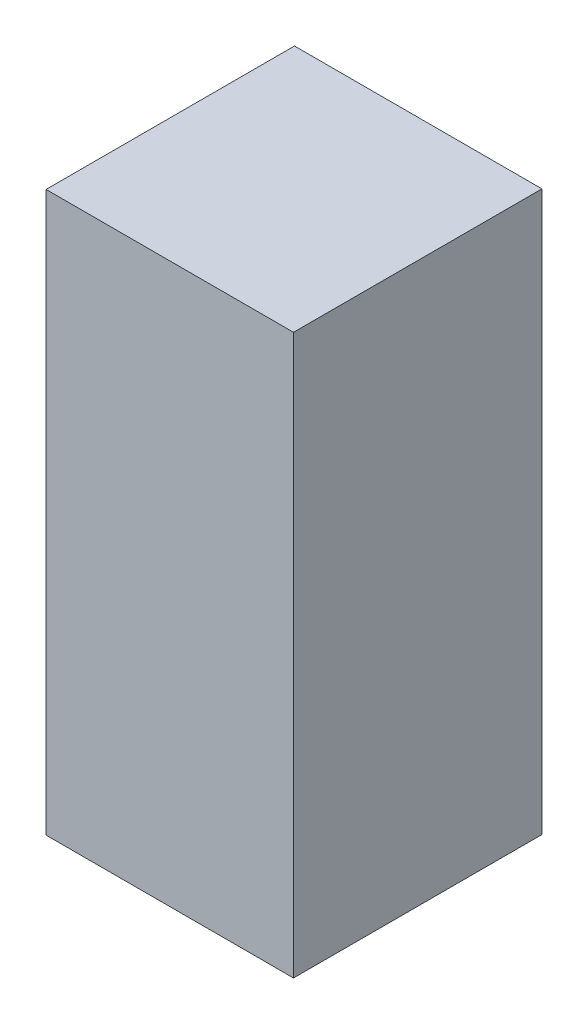
ISO-10303-21;
HEADER;
FILE_DESCRIPTION(('STEP AP214'),'2;1');
FILE_NAME('part.step','',(''),(''),'','','');
FILE_SCHEMA(('AUTOMOTIVE_DESIGN { 1 0 10303 214 1 1 1 1 }'));
ENDSEC;
DATA;
#1=APPLICATION_CONTEXT('core data for automotive mechanical design processes');
#2=APPLICATION_PROTOCOL_DEFINITION('international standard','automotive_design',2000,#1);
#3=PRODUCT_CONTEXT('',#1,'mechanical');
#4=PRODUCT('Part','Part','',(#3));
#5=PRODUCT_RELATED_PRODUCT_CATEGORY('part','',(#4));
#6=PRODUCT_DEFINITION_FORMATION('','',#4);
#7=PRODUCT_DEFINITION_CONTEXT('part definition',#1,'design');
#8=PRODUCT_DEFINITION('design','',#6,#7);
#9=PRODUCT_DEFINITION_SHAPE('','',#8);
#10=(LENGTH_UNIT() NAMED_UNIT(*) SI_UNIT(.MILLI.,.METRE.));
#11=(NAMED_UNIT(*) PLANE_ANGLE_UNIT() SI_UNIT($,.RADIAN.));
#12=(NAMED_UNIT(*) SI_UNIT($,.STERADIAN.) SOLID_ANGLE_UNIT());
#13=UNCERTAINTY_MEASURE_WITH_UNIT(LENGTH_MEASURE(1.E-05),#10,'distance_accuracy_value','');
#14=(GEOMETRIC_REPRESENTATION_CONTEXT(3) GLOBAL_UNCERTAINTY_ASSIGNED_CONTEXT((#13)) GLOBAL_UNIT_ASSIGNED_CONTEXT((#10,
#11,#12)) REPRESENTATION_CONTEXT('',''));
#15=CARTESIAN_POINT('',(0.,0.,0.));
#16=DIRECTION('',(0.,0.,1.));
#17=DIRECTION('',(1.,0.,0.));
#18=AXIS2_PLACEMENT_3D('',#15,#16,#17);
#19=CARTESIAN_POINT('',(-1.98755,-2.53755,0.));
#20=DIRECTION('',(1.,0.,0.));
#21=DIRECTION('',(0.,0.,1.));
#22=AXIS2_PLACEMENT_3D('',#19,#20,#21);
#23=PLANE('',#22);
#24=DIRECTION('',(0.,1.,0.));
#25=VECTOR('',#24,1.);
#26=CARTESIAN_POINT('',(-1.98755,-2.53755,0.1));
#27=LINE('',#26,#25);
#28=CARTESIAN_POINT('',(-1.98755,-2.53755,0.1));
#29=VERTEX_POINT('',#28);
#30=CARTESIAN_POINT('',(-1.98755,-2.31245,0.1));
#31=VERTEX_POINT('',#30);
#32=EDGE_CURVE('E11',#29,#31,#27,.T.);
#33=ORIENTED_EDGE('',*,*,#32,.T.);
#34=DIRECTION('',(0.,0.,1.));
#35=VECTOR('',#34,1.);
#36=CARTESIAN_POINT('',(-1.98755,-2.31245,0.));
#37=LINE('',#36,#35);
#38=CARTESIAN_POINT('',(-1.98755,-2.31245,0.));
#39=VERTEX_POINT('',#38);
#40=EDGE_CURVE('E24',#39,#31,#37,.T.);
#41=ORIENTED_EDGE('',*,*,#40,.F.);
#42=DIRECTION('',(0.,1.,0.));
#43=VECTOR('',#42,1.);
#44=CARTESIAN_POINT('',(-1.98755,-2.53755,0.));
#45=LINE('',#44,#43);
#46=CARTESIAN_POINT('',(-1.98755,-2.53755,0.));
#47=VERTEX_POINT('',#46);
#48=EDGE_CURVE('E86',#47,#39,#45,.T.);
#49=ORIENTED_EDGE('',*,*,#48,.F.);
#50=DIRECTION('',(0.,0.,1.));
#51=VECTOR('',#50,1.);
#52=CARTESIAN_POINT('',(-1.98755,-2.53755,0.));
#53=LINE('',#52,#51);
#54=EDGE_CURVE('E36',#47,#29,#53,.T.);
#55=ORIENTED_EDGE('',*,*,#54,.T.);
#56=EDGE_LOOP('',(#33,#41,#49,#55));
#57=FACE_BOUND('',#56,.T.);
#58=ADVANCED_FACE('F17',(#57),#23,.F.);
#59=CARTESIAN_POINT('',(-1.88795,-2.53755,0.));
#60=DIRECTION('',(1.,0.,0.));
#61=DIRECTION('',(0.,0.,1.));
#62=AXIS2_PLACEMENT_3D('',#59,#60,#61);
#63=PLANE('',#62);
#64=DIRECTION('',(0.,0.,1.));
#65=VECTOR('',#64,1.);
#66=CARTESIAN_POINT('',(-1.88795,-2.53755,0.));
#67=LINE('',#66,#65);
#68=CARTESIAN_POINT('',(-1.88795,-2.53755,0.));
#69=VERTEX_POINT('',#68);
#70=CARTESIAN_POINT('',(-1.88795,-2.53755,0.1));
#71=VERTEX_POINT('',#70);
#72=EDGE_CURVE('E83',#69,#71,#67,.T.);
#73=ORIENTED_EDGE('',*,*,#72,.F.);
#74=DIRECTION('',(0.,1.,0.));
#75=VECTOR('',#74,1.);
#76=CARTESIAN_POINT('',(-1.88795,-2.53755,0.));
#77=LINE('',#76,#75);
#78=CARTESIAN_POINT('',(-1.88795,-2.31245,0.));
#79=VERTEX_POINT('',#78);
#80=EDGE_CURVE('E63',#69,#79,#77,.T.);
#81=ORIENTED_EDGE('',*,*,#80,.T.);
#82=DIRECTION('',(0.,0.,1.));
#83=VECTOR('',#82,1.);
#84=CARTESIAN_POINT('',(-1.88795,-2.31245,0.));
#85=LINE('',#84,#83);
#86=CARTESIAN_POINT('',(-1.88795,-2.31245,0.1));
#87=VERTEX_POINT('',#86);
#88=EDGE_CURVE('E57',#79,#87,#85,.T.);
#89=ORIENTED_EDGE('',*,*,#88,.T.);
#90=DIRECTION('',(0.,1.,0.));
#91=VECTOR('',#90,1.);
#92=CARTESIAN_POINT('',(-1.88795,-2.53755,0.1));
#93=LINE('',#92,#91);
#94=EDGE_CURVE('E60',#71,#87,#93,.T.);
#95=ORIENTED_EDGE('',*,*,#94,.F.);
#96=EDGE_LOOP('',(#73,#81,#89,#95));
#97=FACE_BOUND('',#96,.T.);
#98=ADVANCED_FACE('F59',(#97),#63,.T.);
#99=CARTESIAN_POINT('',(-1.98755,-2.53755,0.));
#100=DIRECTION('',(0.,1.,0.));
#101=DIRECTION('',(0.,0.,1.));
#102=AXIS2_PLACEMENT_3D('',#99,#100,#101);
#103=PLANE('',#102);
#104=ORIENTED_EDGE('',*,*,#72,.T.);
#105=DIRECTION('',(1.,0.,0.));
#106=VECTOR('',#105,1.);
#107=CARTESIAN_POINT('',(-1.98755,-2.53755,0.1));
#108=LINE('',#107,#106);
#109=EDGE_CURVE('E71',#29,#71,#108,.T.);
#110=ORIENTED_EDGE('',*,*,#109,.F.);
#111=ORIENTED_EDGE('',*,*,#54,.F.);
#112=DIRECTION('',(1.,0.,0.));
#113=VECTOR('',#112,1.);
#114=CARTESIAN_POINT('',(-1.98755,-2.53755,0.));
#115=LINE('',#114,#113);
#116=EDGE_CURVE('E76',#47,#69,#115,.T.);
#117=ORIENTED_EDGE('',*,*,#116,.T.);
#118=EDGE_LOOP('',(#104,#110,#111,#117));
#119=FACE_BOUND('',#118,.T.);
#120=ADVANCED_FACE('F91',(#119),#103,.F.);
#121=CARTESIAN_POINT('',(-1.98755,-2.31245,0.));
#122=DIRECTION('',(0.,1.,0.));
#123=DIRECTION('',(0.,0.,1.));
#124=AXIS2_PLACEMENT_3D('',#121,#122,#123);
#125=PLANE('',#124);
#126=DIRECTION('',(1.,0.,0.));
#127=VECTOR('',#126,1.);
#128=CARTESIAN_POINT('',(-1.98755,-2.31245,0.));
#129=LINE('',#128,#127);
#130=EDGE_CURVE('E74',#39,#79,#129,.T.);
#131=ORIENTED_EDGE('',*,*,#130,.F.);
#132=ORIENTED_EDGE('',*,*,#40,.T.);
#133=DIRECTION('',(1.,0.,0.));
#134=VECTOR('',#133,1.);
#135=CARTESIAN_POINT('',(-1.98755,-2.31245,0.1));
#136=LINE('',#135,#134);
#137=EDGE_CURVE('E69',#31,#87,#136,.T.);
#138=ORIENTED_EDGE('',*,*,#137,.T.);
#139=ORIENTED_EDGE('',*,*,#88,.F.);
#140=EDGE_LOOP('',(#131,#132,#138,#139));
#141=FACE_BOUND('',#140,.T.);
#142=ADVANCED_FACE('F73',(#141),#125,.T.);
#143=CARTESIAN_POINT('',(-1.98755,-2.53755,0.));
#144=DIRECTION('',(0.,0.,1.));
#145=DIRECTION('',(1.,0.,0.));
#146=AXIS2_PLACEMENT_3D('',#143,#144,#145);
#147=PLANE('',#146);
#148=ORIENTED_EDGE('',*,*,#130,.T.);
#149=ORIENTED_EDGE('',*,*,#80,.F.);
#150=ORIENTED_EDGE('',*,*,#116,.F.);
#151=ORIENTED_EDGE('',*,*,#48,.T.);
#152=EDGE_LOOP('',(#148,#149,#150,#151));
#153=FACE_BOUND('',#152,.T.);
#154=ADVANCED_FACE('F89',(#153),#147,.F.);
#155=CARTESIAN_POINT('',(-1.98755,-2.53755,0.1));
#156=DIRECTION('',(0.,0.,1.));
#157=DIRECTION('',(1.,0.,0.));
#158=AXIS2_PLACEMENT_3D('',#155,#156,#157);
#159=PLANE('',#158);
#160=ORIENTED_EDGE('',*,*,#32,.F.);
#161=ORIENTED_EDGE('',*,*,#109,.T.);
#162=ORIENTED_EDGE('',*,*,#94,.T.);
#163=ORIENTED_EDGE('',*,*,#137,.F.);
#164=EDGE_LOOP('',(#160,#161,#162,#163));
#165=FACE_BOUND('',#164,.T.);
#166=ADVANCED_FACE('F68',(#165),#159,.T.);
#167=CLOSED_SHELL('',(#58,#98,#120,#142,#154,#166));
#168=MANIFOLD_SOLID_BREP('B1',#167);
#169=ADVANCED_BREP_SHAPE_REPRESENTATION('',(#18,#168),#14);
#170=SHAPE_DEFINITION_REPRESENTATION(#9,#169);
ENDSEC;
END-ISO-10303-21;
